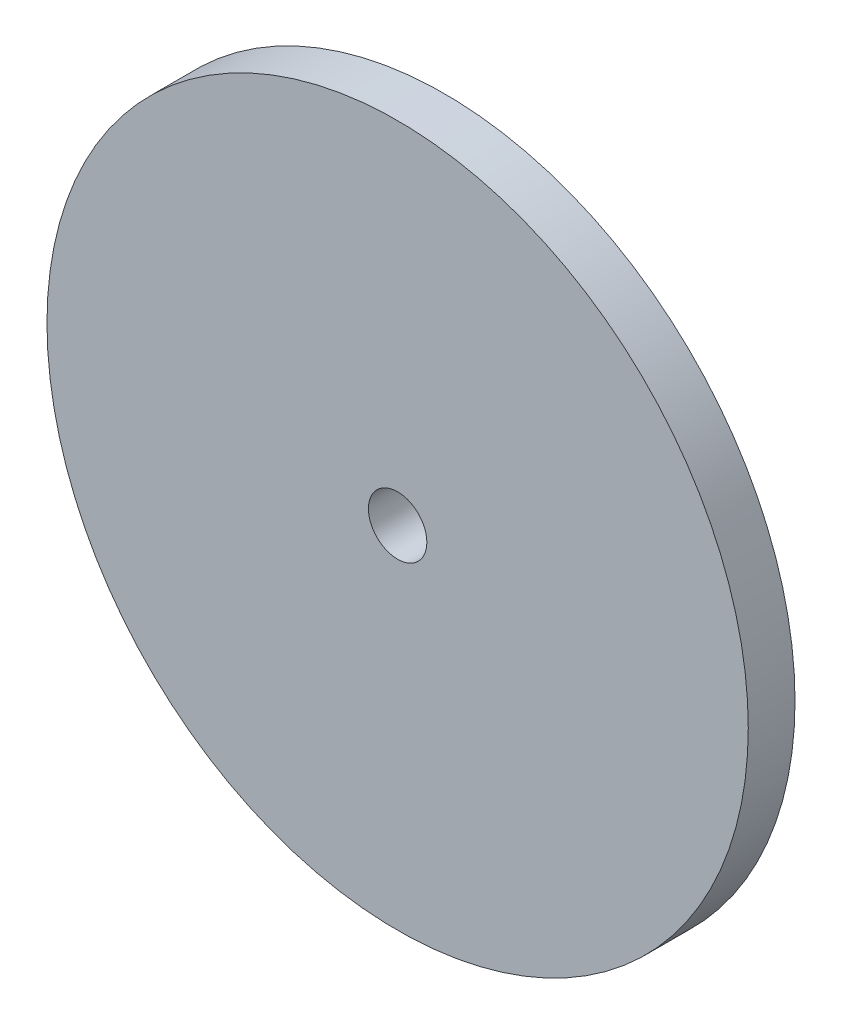
ISO-10303-21;
HEADER;
FILE_DESCRIPTION(('STEP AP214'),'2;1');
FILE_NAME('part.step','',(''),(''),'','','');
FILE_SCHEMA(('AUTOMOTIVE_DESIGN { 1 0 10303 214 1 1 1 1 }'));
ENDSEC;
DATA;
#1=APPLICATION_CONTEXT('core data for automotive mechanical design processes');
#2=APPLICATION_PROTOCOL_DEFINITION('international standard','automotive_design',2000,#1);
#3=PRODUCT_CONTEXT('',#1,'mechanical');
#4=PRODUCT('Part','Part','',(#3));
#5=PRODUCT_RELATED_PRODUCT_CATEGORY('part','',(#4));
#6=PRODUCT_DEFINITION_FORMATION('','',#4);
#7=PRODUCT_DEFINITION_CONTEXT('part definition',#1,'design');
#8=PRODUCT_DEFINITION('design','',#6,#7);
#9=PRODUCT_DEFINITION_SHAPE('','',#8);
#10=(LENGTH_UNIT() NAMED_UNIT(*) SI_UNIT(.MILLI.,.METRE.));
#11=(NAMED_UNIT(*) PLANE_ANGLE_UNIT() SI_UNIT($,.RADIAN.));
#12=(NAMED_UNIT(*) SI_UNIT($,.STERADIAN.) SOLID_ANGLE_UNIT());
#13=UNCERTAINTY_MEASURE_WITH_UNIT(LENGTH_MEASURE(1.E-05),#10,'distance_accuracy_value','');
#14=(GEOMETRIC_REPRESENTATION_CONTEXT(3) GLOBAL_UNCERTAINTY_ASSIGNED_CONTEXT((#13)) GLOBAL_UNIT_ASSIGNED_CONTEXT((#10,
#11,#12)) REPRESENTATION_CONTEXT('',''));
#15=CARTESIAN_POINT('',(0.,0.,0.));
#16=DIRECTION('',(0.,0.,1.));
#17=DIRECTION('',(1.,0.,0.));
#18=AXIS2_PLACEMENT_3D('',#15,#16,#17);
#19=CARTESIAN_POINT('',(0.,0.,4.));
#20=DIRECTION('',(0.,0.,-1.));
#21=DIRECTION('',(-1.,0.,0.));
#22=AXIS2_PLACEMENT_3D('',#19,#20,#21);
#23=CYLINDRICAL_SURFACE('',#22,30.);
#24=CARTESIAN_POINT('',(0.,0.,4.));
#25=DIRECTION('',(0.,0.,1.));
#26=DIRECTION('',(1.,0.,0.));
#27=AXIS2_PLACEMENT_3D('',#24,#25,#26);
#28=CIRCLE('',#27,30.);
#29=CARTESIAN_POINT('',(30.,0.,4.));
#30=VERTEX_POINT('',#29);
#31=EDGE_CURVE('E10',#30,#30,#28,.T.);
#32=ORIENTED_EDGE('',*,*,#31,.F.);
#33=EDGE_LOOP('',(#32));
#34=FACE_BOUND('',#33,.T.);
#35=CARTESIAN_POINT('',(0.,0.,0.));
#36=DIRECTION('',(0.,0.,1.));
#37=DIRECTION('',(1.,0.,0.));
#38=AXIS2_PLACEMENT_3D('',#35,#36,#37);
#39=CIRCLE('',#38,30.);
#40=CARTESIAN_POINT('',(30.,0.,0.));
#41=VERTEX_POINT('',#40);
#42=EDGE_CURVE('E34',#41,#41,#39,.T.);
#43=ORIENTED_EDGE('',*,*,#42,.T.);
#44=EDGE_LOOP('',(#43));
#45=FACE_BOUND('',#44,.T.);
#46=ADVANCED_FACE('F31',(#34,#45),#23,.T.);
#47=CARTESIAN_POINT('',(0.,0.,4.));
#48=DIRECTION('',(0.,0.,1.));
#49=DIRECTION('',(1.,0.,0.));
#50=AXIS2_PLACEMENT_3D('',#47,#48,#49);
#51=PLANE('',#50);
#52=CARTESIAN_POINT('',(0.,0.,4.));
#53=DIRECTION('',(0.,0.,1.));
#54=DIRECTION('',(1.,0.,0.));
#55=AXIS2_PLACEMENT_3D('',#52,#53,#54);
#56=CIRCLE('',#55,2.5);
#57=CARTESIAN_POINT('',(2.5,0.,4.));
#58=VERTEX_POINT('',#57);
#59=EDGE_CURVE('E43',#58,#58,#56,.T.);
#60=ORIENTED_EDGE('',*,*,#59,.F.);
#61=EDGE_LOOP('',(#60));
#62=FACE_BOUND('',#61,.T.);
#63=ORIENTED_EDGE('',*,*,#31,.T.);
#64=EDGE_LOOP('',(#63));
#65=FACE_BOUND('',#64,.T.);
#66=ADVANCED_FACE('F58',(#62,#65),#51,.T.);
#67=CARTESIAN_POINT('',(0.,0.,0.));
#68=DIRECTION('',(0.,0.,1.));
#69=DIRECTION('',(1.,0.,0.));
#70=AXIS2_PLACEMENT_3D('',#67,#68,#69);
#71=PLANE('',#70);
#72=CARTESIAN_POINT('',(0.,0.,0.));
#73=DIRECTION('',(0.,0.,1.));
#74=DIRECTION('',(1.,0.,0.));
#75=AXIS2_PLACEMENT_3D('',#72,#73,#74);
#76=CIRCLE('',#75,2.5);
#77=CARTESIAN_POINT('',(2.5,0.,0.));
#78=VERTEX_POINT('',#77);
#79=EDGE_CURVE('E41',#78,#78,#76,.T.);
#80=ORIENTED_EDGE('',*,*,#79,.T.);
#81=EDGE_LOOP('',(#80));
#82=FACE_BOUND('',#81,.T.);
#83=ORIENTED_EDGE('',*,*,#42,.F.);
#84=EDGE_LOOP('',(#83));
#85=FACE_BOUND('',#84,.T.);
#86=ADVANCED_FACE('F49',(#82,#85),#71,.F.);
#87=CARTESIAN_POINT('',(0.,0.,0.));
#88=DIRECTION('',(0.,0.,1.));
#89=DIRECTION('',(1.,0.,0.));
#90=AXIS2_PLACEMENT_3D('',#87,#88,#89);
#91=CYLINDRICAL_SURFACE('',#90,2.5);
#92=ORIENTED_EDGE('',*,*,#79,.F.);
#93=EDGE_LOOP('',(#92));
#94=FACE_BOUND('',#93,.T.);
#95=ORIENTED_EDGE('',*,*,#59,.T.);
#96=EDGE_LOOP('',(#95));
#97=FACE_BOUND('',#96,.T.);
#98=ADVANCED_FACE('F52',(#94,#97),#91,.F.);
#99=CLOSED_SHELL('',(#46,#66,#86,#98));
#100=MANIFOLD_SOLID_BREP('B2',#99);
#101=ADVANCED_BREP_SHAPE_REPRESENTATION('',(#18,#100),#14);
#102=SHAPE_DEFINITION_REPRESENTATION(#9,#101);
ENDSEC;
END-ISO-10303-21;
